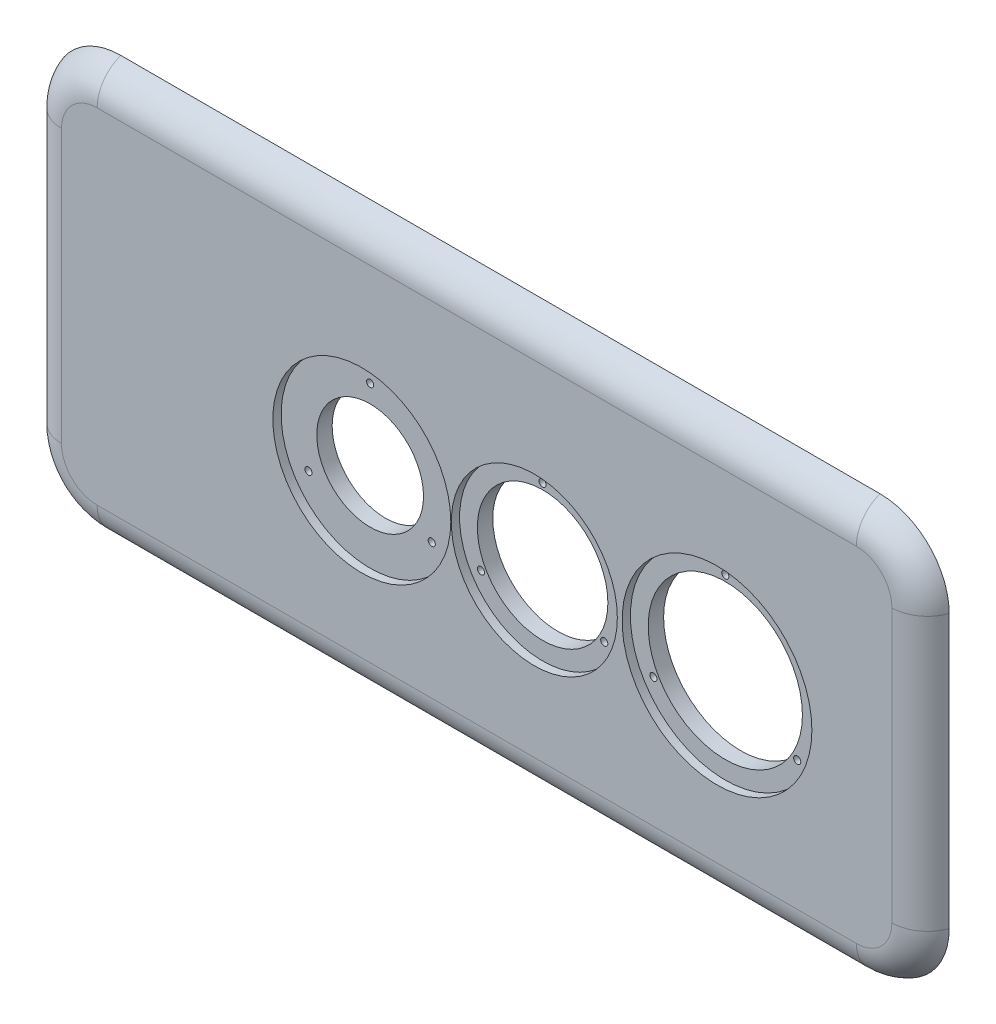
ISO-10303-21;
HEADER;
FILE_DESCRIPTION(('STEP AP214'),'2;1');
FILE_NAME('part.step','',(''),(''),'','','');
FILE_SCHEMA(('AUTOMOTIVE_DESIGN { 1 0 10303 214 1 1 1 1 }'));
ENDSEC;
DATA;
#1=APPLICATION_CONTEXT('core data for automotive mechanical design processes');
#2=APPLICATION_PROTOCOL_DEFINITION('international standard','automotive_design',2000,#1);
#3=PRODUCT_CONTEXT('',#1,'mechanical');
#4=PRODUCT('Part','Part','',(#3));
#5=PRODUCT_RELATED_PRODUCT_CATEGORY('part','',(#4));
#6=PRODUCT_DEFINITION_FORMATION('','',#4);
#7=PRODUCT_DEFINITION_CONTEXT('part definition',#1,'design');
#8=PRODUCT_DEFINITION('design','',#6,#7);
#9=PRODUCT_DEFINITION_SHAPE('','',#8);
#10=(LENGTH_UNIT() NAMED_UNIT(*) SI_UNIT(.MILLI.,.METRE.));
#11=(NAMED_UNIT(*) PLANE_ANGLE_UNIT() SI_UNIT($,.RADIAN.));
#12=(NAMED_UNIT(*) SI_UNIT($,.STERADIAN.) SOLID_ANGLE_UNIT());
#13=UNCERTAINTY_MEASURE_WITH_UNIT(LENGTH_MEASURE(1.E-05),#10,'distance_accuracy_value','');
#14=(GEOMETRIC_REPRESENTATION_CONTEXT(3) GLOBAL_UNCERTAINTY_ASSIGNED_CONTEXT((#13)) GLOBAL_UNIT_ASSIGNED_CONTEXT((#10,
#11,#12)) REPRESENTATION_CONTEXT('',''));
#15=CARTESIAN_POINT('',(0.,0.,0.));
#16=DIRECTION('',(0.,0.,1.));
#17=DIRECTION('',(1.,0.,0.));
#18=AXIS2_PLACEMENT_3D('',#15,#16,#17);
#19=CARTESIAN_POINT('',(245.403137254902,24.6560784313726,0.));
#20=DIRECTION('',(0.,0.,1.));
#21=DIRECTION('',(1.,0.,0.));
#22=AXIS2_PLACEMENT_3D('',#19,#20,#21);
#23=CYLINDRICAL_SURFACE('',#22,65.);
#24=CARTESIAN_POINT('',(245.403137254902,24.6560784313726,18.));
#25=DIRECTION('',(0.,0.,-1.));
#26=DIRECTION('',(-1.,0.,0.));
#27=AXIS2_PLACEMENT_3D('',#24,#25,#26);
#28=CIRCLE('',#27,65.);
#29=CARTESIAN_POINT('',(180.403137254902,24.6560784313726,18.));
#30=VERTEX_POINT('',#29);
#31=EDGE_CURVE('E270',#30,#30,#28,.F.);
#32=ORIENTED_EDGE('',*,*,#31,.F.);
#33=EDGE_LOOP('',(#32));
#34=FACE_BOUND('',#33,.T.);
#35=CARTESIAN_POINT('',(245.403137254902,24.6560784313726,31.));
#36=DIRECTION('',(0.,0.,1.));
#37=DIRECTION('',(1.,0.,0.));
#38=AXIS2_PLACEMENT_3D('',#35,#36,#37);
#39=CIRCLE('',#38,65.);
#40=CARTESIAN_POINT('',(310.403137254902,24.6560784313726,31.));
#41=VERTEX_POINT('',#40);
#42=EDGE_CURVE('E607',#41,#41,#39,.F.);
#43=ORIENTED_EDGE('',*,*,#42,.F.);
#44=EDGE_LOOP('',(#43));
#45=FACE_BOUND('',#44,.T.);
#46=ADVANCED_FACE('F42',(#34,#45),#23,.F.);
#47=CARTESIAN_POINT('',(91.4031372549019,24.6560784313726,0.));
#48=DIRECTION('',(0.,0.,1.));
#49=DIRECTION('',(1.,0.,0.));
#50=AXIS2_PLACEMENT_3D('',#47,#48,#49);
#51=CYLINDRICAL_SURFACE('',#50,55.);
#52=CARTESIAN_POINT('',(91.4031372549019,24.6560784313726,31.));
#53=DIRECTION('',(0.,0.,1.));
#54=DIRECTION('',(1.,0.,0.));
#55=AXIS2_PLACEMENT_3D('',#52,#53,#54);
#56=CIRCLE('',#55,55.);
#57=CARTESIAN_POINT('',(146.403137254902,24.6560784313726,31.));
#58=VERTEX_POINT('',#57);
#59=EDGE_CURVE('E165',#58,#58,#56,.F.);
#60=ORIENTED_EDGE('',*,*,#59,.F.);
#61=EDGE_LOOP('',(#60));
#62=FACE_BOUND('',#61,.T.);
#63=CARTESIAN_POINT('',(91.4031372549019,24.6560784313726,18.));
#64=DIRECTION('',(0.,0.,-1.));
#65=DIRECTION('',(-1.,0.,0.));
#66=AXIS2_PLACEMENT_3D('',#63,#64,#65);
#67=CIRCLE('',#66,55.);
#68=CARTESIAN_POINT('',(36.4031372549019,24.6560784313726,18.));
#69=VERTEX_POINT('',#68);
#70=EDGE_CURVE('E131',#69,#69,#67,.F.);
#71=ORIENTED_EDGE('',*,*,#70,.F.);
#72=EDGE_LOOP('',(#71));
#73=FACE_BOUND('',#72,.T.);
#74=ADVANCED_FACE('F305',(#62,#73),#51,.F.);
#75=CARTESIAN_POINT('',(-54.0068627450981,24.6560784313725,0.));
#76=DIRECTION('',(0.,0.,1.));
#77=DIRECTION('',(1.,0.,0.));
#78=AXIS2_PLACEMENT_3D('',#75,#76,#77);
#79=CYLINDRICAL_SURFACE('',#78,45.);
#80=CARTESIAN_POINT('',(-54.0068627450981,24.6560784313725,31.));
#81=DIRECTION('',(0.,0.,1.));
#82=DIRECTION('',(1.,0.,0.));
#83=AXIS2_PLACEMENT_3D('',#80,#81,#82);
#84=CIRCLE('',#83,45.);
#85=CARTESIAN_POINT('',(-9.00686274509806,24.6560784313725,31.));
#86=VERTEX_POINT('',#85);
#87=EDGE_CURVE('E189',#86,#86,#84,.F.);
#88=ORIENTED_EDGE('',*,*,#87,.F.);
#89=EDGE_LOOP('',(#88));
#90=FACE_BOUND('',#89,.T.);
#91=CARTESIAN_POINT('',(-54.0068627450981,24.6560784313725,18.));
#92=DIRECTION('',(0.,0.,-1.));
#93=DIRECTION('',(-1.,0.,0.));
#94=AXIS2_PLACEMENT_3D('',#91,#92,#93);
#95=CIRCLE('',#94,45.);
#96=CARTESIAN_POINT('',(-99.006862745098,24.6560784313725,18.));
#97=VERTEX_POINT('',#96);
#98=EDGE_CURVE('E274',#97,#97,#95,.F.);
#99=ORIENTED_EDGE('',*,*,#98,.F.);
#100=EDGE_LOOP('',(#99));
#101=FACE_BOUND('',#100,.T.);
#102=ADVANCED_FACE('F301',(#90,#101),#79,.F.);
#103=CARTESIAN_POINT('',(91.4031372549019,84.6560784313725,0.));
#104=DIRECTION('',(0.,0.,1.));
#105=DIRECTION('',(1.,0.,0.));
#106=AXIS2_PLACEMENT_3D('',#103,#104,#105);
#107=CYLINDRICAL_SURFACE('',#106,3.00000000000001);
#108=CARTESIAN_POINT('',(91.4031372549019,84.6560784313725,31.));
#109=DIRECTION('',(0.,0.,1.));
#110=DIRECTION('',(1.,0.,0.));
#111=AXIS2_PLACEMENT_3D('',#108,#109,#110);
#112=CIRCLE('',#111,3.00000000000001);
#113=CARTESIAN_POINT('',(94.4031372549019,84.6560784313725,31.));
#114=VERTEX_POINT('',#113);
#115=EDGE_CURVE('E149',#114,#114,#112,.T.);
#116=ORIENTED_EDGE('',*,*,#115,.T.);
#117=EDGE_LOOP('',(#116));
#118=FACE_BOUND('',#117,.T.);
#119=CARTESIAN_POINT('',(91.4031372549019,84.6560784313725,18.));
#120=DIRECTION('',(0.,0.,-1.));
#121=DIRECTION('',(-1.,0.,0.));
#122=AXIS2_PLACEMENT_3D('',#119,#120,#121);
#123=CIRCLE('',#122,3.00000000000001);
#124=CARTESIAN_POINT('',(88.4031372549019,84.6560784313725,18.));
#125=VERTEX_POINT('',#124);
#126=EDGE_CURVE('E266',#125,#125,#123,.F.);
#127=ORIENTED_EDGE('',*,*,#126,.F.);
#128=EDGE_LOOP('',(#127));
#129=FACE_BOUND('',#128,.T.);
#130=ADVANCED_FACE('F304',(#118,#129),#107,.F.);
#131=CARTESIAN_POINT('',(39.4416130278356,-5.34392156862745,0.));
#132=DIRECTION('',(0.,0.,1.));
#133=DIRECTION('',(1.,0.,0.));
#134=AXIS2_PLACEMENT_3D('',#131,#132,#133);
#135=CYLINDRICAL_SURFACE('',#134,2.99999999999769);
#136=CARTESIAN_POINT('',(39.4416130278356,-5.34392156862745,31.));
#137=DIRECTION('',(0.,0.,1.));
#138=DIRECTION('',(1.,0.,0.));
#139=AXIS2_PLACEMENT_3D('',#136,#137,#138);
#140=CIRCLE('',#139,2.99999999999769);
#141=CARTESIAN_POINT('',(42.4416130278333,-5.34392156862745,31.));
#142=VERTEX_POINT('',#141);
#143=EDGE_CURVE('E156',#142,#142,#140,.T.);
#144=ORIENTED_EDGE('',*,*,#143,.T.);
#145=EDGE_LOOP('',(#144));
#146=FACE_BOUND('',#145,.T.);
#147=CARTESIAN_POINT('',(39.4416130278356,-5.34392156862745,18.));
#148=DIRECTION('',(0.,0.,-1.));
#149=DIRECTION('',(-1.,0.,0.));
#150=AXIS2_PLACEMENT_3D('',#147,#148,#149);
#151=CIRCLE('',#150,2.99999999999769);
#152=CARTESIAN_POINT('',(36.4416130278379,-5.34392156862745,18.));
#153=VERTEX_POINT('',#152);
#154=EDGE_CURVE('E262',#153,#153,#151,.F.);
#155=ORIENTED_EDGE('',*,*,#154,.F.);
#156=EDGE_LOOP('',(#155));
#157=FACE_BOUND('',#156,.T.);
#158=ADVANCED_FACE('F364',(#146,#157),#135,.F.);
#159=CARTESIAN_POINT('',(143.364661481968,-5.3439215686274,0.));
#160=DIRECTION('',(0.,0.,1.));
#161=DIRECTION('',(1.,0.,0.));
#162=AXIS2_PLACEMENT_3D('',#159,#160,#161);
#163=CYLINDRICAL_SURFACE('',#162,2.99999999999833);
#164=CARTESIAN_POINT('',(143.364661481968,-5.3439215686274,31.));
#165=DIRECTION('',(0.,0.,1.));
#166=DIRECTION('',(1.,0.,0.));
#167=AXIS2_PLACEMENT_3D('',#164,#165,#166);
#168=CIRCLE('',#167,2.99999999999833);
#169=CARTESIAN_POINT('',(146.364661481967,-5.3439215686274,31.));
#170=VERTEX_POINT('',#169);
#171=EDGE_CURVE('E162',#170,#170,#168,.T.);
#172=ORIENTED_EDGE('',*,*,#171,.T.);
#173=EDGE_LOOP('',(#172));
#174=FACE_BOUND('',#173,.T.);
#175=CARTESIAN_POINT('',(143.364661481968,-5.3439215686274,18.));
#176=DIRECTION('',(0.,0.,-1.));
#177=DIRECTION('',(-1.,0.,0.));
#178=AXIS2_PLACEMENT_3D('',#175,#176,#177);
#179=CIRCLE('',#178,2.99999999999833);
#180=CARTESIAN_POINT('',(140.36466148197,-5.3439215686274,18.));
#181=VERTEX_POINT('',#180);
#182=EDGE_CURVE('E258',#181,#181,#179,.F.);
#183=ORIENTED_EDGE('',*,*,#182,.F.);
#184=EDGE_LOOP('',(#183));
#185=FACE_BOUND('',#184,.T.);
#186=ADVANCED_FACE('F367',(#174,#185),#163,.F.);
#187=CARTESIAN_POINT('',(-54.0068627450981,84.6560784313725,0.));
#188=DIRECTION('',(0.,0.,1.));
#189=DIRECTION('',(1.,0.,0.));
#190=AXIS2_PLACEMENT_3D('',#187,#188,#189);
#191=CYLINDRICAL_SURFACE('',#190,3.);
#192=CARTESIAN_POINT('',(-54.0068627450981,84.6560784313725,31.));
#193=DIRECTION('',(0.,0.,1.));
#194=DIRECTION('',(1.,0.,0.));
#195=AXIS2_PLACEMENT_3D('',#192,#193,#194);
#196=CIRCLE('',#195,3.);
#197=CARTESIAN_POINT('',(-51.0068627450981,84.6560784313725,31.));
#198=VERTEX_POINT('',#197);
#199=EDGE_CURVE('E171',#198,#198,#196,.T.);
#200=ORIENTED_EDGE('',*,*,#199,.T.);
#201=EDGE_LOOP('',(#200));
#202=FACE_BOUND('',#201,.T.);
#203=CARTESIAN_POINT('',(-54.0068627450981,84.6560784313725,18.));
#204=DIRECTION('',(0.,0.,-1.));
#205=DIRECTION('',(-1.,0.,0.));
#206=AXIS2_PLACEMENT_3D('',#203,#204,#205);
#207=CIRCLE('',#206,3.);
#208=CARTESIAN_POINT('',(-57.0068627450981,84.6560784313725,18.));
#209=VERTEX_POINT('',#208);
#210=EDGE_CURVE('E254',#209,#209,#207,.F.);
#211=ORIENTED_EDGE('',*,*,#210,.F.);
#212=EDGE_LOOP('',(#211));
#213=FACE_BOUND('',#212,.T.);
#214=ADVANCED_FACE('F357',(#202,#213),#191,.F.);
#215=CARTESIAN_POINT('',(-105.968386972163,-5.34392156862772,0.));
#216=DIRECTION('',(0.,0.,1.));
#217=DIRECTION('',(1.,0.,0.));
#218=AXIS2_PLACEMENT_3D('',#215,#216,#217);
#219=CYLINDRICAL_SURFACE('',#218,3.00000000000001);
#220=CARTESIAN_POINT('',(-105.968386972163,-5.34392156862772,31.));
#221=DIRECTION('',(0.,0.,1.));
#222=DIRECTION('',(1.,0.,0.));
#223=AXIS2_PLACEMENT_3D('',#220,#221,#222);
#224=CIRCLE('',#223,3.00000000000001);
#225=CARTESIAN_POINT('',(-102.968386972163,-5.34392156862772,31.));
#226=VERTEX_POINT('',#225);
#227=EDGE_CURVE('E175',#226,#226,#224,.T.);
#228=ORIENTED_EDGE('',*,*,#227,.T.);
#229=EDGE_LOOP('',(#228));
#230=FACE_BOUND('',#229,.T.);
#231=CARTESIAN_POINT('',(-105.968386972163,-5.34392156862772,18.));
#232=DIRECTION('',(0.,0.,-1.));
#233=DIRECTION('',(-1.,0.,0.));
#234=AXIS2_PLACEMENT_3D('',#231,#232,#233);
#235=CIRCLE('',#234,3.00000000000001);
#236=CARTESIAN_POINT('',(-108.968386972163,-5.34392156862772,18.));
#237=VERTEX_POINT('',#236);
#238=EDGE_CURVE('E250',#237,#237,#235,.F.);
#239=ORIENTED_EDGE('',*,*,#238,.F.);
#240=EDGE_LOOP('',(#239));
#241=FACE_BOUND('',#240,.T.);
#242=ADVANCED_FACE('F351',(#230,#241),#219,.F.);
#243=CARTESIAN_POINT('',(-2.0453385180306,-5.34392156862697,0.));
#244=DIRECTION('',(0.,0.,1.));
#245=DIRECTION('',(1.,0.,0.));
#246=AXIS2_PLACEMENT_3D('',#243,#244,#245);
#247=CYLINDRICAL_SURFACE('',#246,3.);
#248=CARTESIAN_POINT('',(-2.0453385180306,-5.34392156862697,31.));
#249=DIRECTION('',(0.,0.,1.));
#250=DIRECTION('',(1.,0.,0.));
#251=AXIS2_PLACEMENT_3D('',#248,#249,#250);
#252=CIRCLE('',#251,3.);
#253=CARTESIAN_POINT('',(0.954661481969402,-5.34392156862697,31.));
#254=VERTEX_POINT('',#253);
#255=EDGE_CURVE('E179',#254,#254,#252,.T.);
#256=ORIENTED_EDGE('',*,*,#255,.T.);
#257=EDGE_LOOP('',(#256));
#258=FACE_BOUND('',#257,.T.);
#259=CARTESIAN_POINT('',(-2.0453385180306,-5.34392156862697,18.));
#260=DIRECTION('',(0.,0.,-1.));
#261=DIRECTION('',(-1.,0.,0.));
#262=AXIS2_PLACEMENT_3D('',#259,#260,#261);
#263=CIRCLE('',#262,3.);
#264=CARTESIAN_POINT('',(-5.0453385180306,-5.34392156862697,18.));
#265=VERTEX_POINT('',#264);
#266=EDGE_CURVE('E246',#265,#265,#263,.F.);
#267=ORIENTED_EDGE('',*,*,#266,.F.);
#268=EDGE_LOOP('',(#267));
#269=FACE_BOUND('',#268,.T.);
#270=ADVANCED_FACE('F347',(#258,#269),#247,.F.);
#271=CARTESIAN_POINT('',(-277.156862745098,-82.3039215686274,8.));
#272=DIRECTION('',(0.,0.,1.));
#273=DIRECTION('',(1.,0.,0.));
#274=AXIS2_PLACEMENT_3D('',#271,#272,#273);
#275=DEGENERATE_TOROIDAL_SURFACE('',#274,30.,30.,.T.);
#276=CARTESIAN_POINT('',(-307.156862745098,-82.3039215686274,8.));
#277=DIRECTION('',(0.,1.,0.));
#278=DIRECTION('',(0.,0.,1.));
#279=AXIS2_PLACEMENT_3D('',#276,#277,#278);
#280=CIRCLE('',#279,30.);
#281=CARTESIAN_POINT('',(-335.44113399256,-82.3039215686274,18.));
#282=VERTEX_POINT('',#281);
#283=CARTESIAN_POINT('',(-307.156862745098,-82.3039215686274,38.));
#284=VERTEX_POINT('',#283);
#285=EDGE_CURVE('E144',#282,#284,#280,.T.);
#286=ORIENTED_EDGE('',*,*,#285,.F.);
#287=CARTESIAN_POINT('',(-277.156862745098,-82.3039215686274,18.));
#288=DIRECTION('',(0.,0.,-1.));
#289=DIRECTION('',(-1.,0.,0.));
#290=AXIS2_PLACEMENT_3D('',#287,#288,#289);
#291=CIRCLE('',#290,58.2842712474619);
#292=CARTESIAN_POINT('',(-277.156862745098,-140.588192816089,18.));
#293=VERTEX_POINT('',#292);
#294=EDGE_CURVE('E227',#282,#293,#291,.F.);
#295=ORIENTED_EDGE('',*,*,#294,.T.);
#296=CARTESIAN_POINT('',(-277.156862745098,-112.303921568627,8.));
#297=DIRECTION('',(1.,0.,0.));
#298=DIRECTION('',(0.,0.,-1.));
#299=AXIS2_PLACEMENT_3D('',#296,#297,#298);
#300=CIRCLE('',#299,30.);
#301=CARTESIAN_POINT('',(-277.156862745098,-112.303921568627,38.));
#302=VERTEX_POINT('',#301);
#303=EDGE_CURVE('E146',#302,#293,#300,.T.);
#304=ORIENTED_EDGE('',*,*,#303,.F.);
#305=CARTESIAN_POINT('',(-277.156862745098,-82.3039215686274,38.));
#306=DIRECTION('',(0.,0.,1.));
#307=DIRECTION('',(1.,0.,0.));
#308=AXIS2_PLACEMENT_3D('',#305,#306,#307);
#309=CIRCLE('',#308,30.);
#310=EDGE_CURVE('E197',#284,#302,#309,.T.);
#311=ORIENTED_EDGE('',*,*,#310,.F.);
#312=EDGE_LOOP('',(#286,#295,#304,#311));
#313=FACE_BOUND('',#312,.T.);
#314=ADVANCED_FACE('F44',(#313),#275,.T.);
#315=CARTESIAN_POINT('',(0.,-112.303921568627,8.));
#316=DIRECTION('',(-1.,0.,0.));
#317=DIRECTION('',(0.,0.,1.));
#318=AXIS2_PLACEMENT_3D('',#315,#316,#317);
#319=CYLINDRICAL_SURFACE('',#318,30.);
#320=ORIENTED_EDGE('',*,*,#303,.T.);
#321=DIRECTION('',(-1.,0.,0.));
#322=VECTOR('',#321,1.);
#323=CARTESIAN_POINT('',(0.,-140.588192816089,18.));
#324=LINE('',#323,#322);
#325=CARTESIAN_POINT('',(362.843137254901,-140.588192816089,18.));
#326=VERTEX_POINT('',#325);
#327=EDGE_CURVE('E238',#293,#326,#324,.F.);
#328=ORIENTED_EDGE('',*,*,#327,.T.);
#329=CARTESIAN_POINT('',(362.843137254902,-112.303921568627,8.));
#330=DIRECTION('',(1.,0.,0.));
#331=DIRECTION('',(0.,1.,0.));
#332=AXIS2_PLACEMENT_3D('',#329,#330,#331);
#333=CIRCLE('',#332,30.);
#334=CARTESIAN_POINT('',(362.843137254902,-112.303921568627,38.));
#335=VERTEX_POINT('',#334);
#336=EDGE_CURVE('E140',#335,#326,#333,.T.);
#337=ORIENTED_EDGE('',*,*,#336,.F.);
#338=DIRECTION('',(1.,0.,0.));
#339=VECTOR('',#338,1.);
#340=CARTESIAN_POINT('',(362.843137254901,-112.303921568627,38.));
#341=LINE('',#340,#339);
#342=EDGE_CURVE('E200',#302,#335,#341,.T.);
#343=ORIENTED_EDGE('',*,*,#342,.F.);
#344=EDGE_LOOP('',(#320,#328,#337,#343));
#345=FACE_BOUND('',#344,.T.);
#346=ADVANCED_FACE('F229',(#345),#319,.T.);
#347=CARTESIAN_POINT('',(-307.156862745098,0.,8.));
#348=DIRECTION('',(0.,1.,0.));
#349=DIRECTION('',(-1.,0.,0.));
#350=AXIS2_PLACEMENT_3D('',#347,#348,#349);
#351=CYLINDRICAL_SURFACE('',#350,30.);
#352=CARTESIAN_POINT('',(-307.156862745098,147.696078431372,8.));
#353=DIRECTION('',(0.,1.,0.));
#354=DIRECTION('',(0.,0.,1.));
#355=AXIS2_PLACEMENT_3D('',#352,#353,#354);
#356=CIRCLE('',#355,30.);
#357=CARTESIAN_POINT('',(-335.44113399256,147.696078431372,18.));
#358=VERTEX_POINT('',#357);
#359=CARTESIAN_POINT('',(-307.156862745098,147.696078431372,38.));
#360=VERTEX_POINT('',#359);
#361=EDGE_CURVE('E137',#358,#360,#356,.T.);
#362=ORIENTED_EDGE('',*,*,#361,.F.);
#363=DIRECTION('',(0.,1.,0.));
#364=VECTOR('',#363,1.);
#365=CARTESIAN_POINT('',(-335.44113399256,0.,18.));
#366=LINE('',#365,#364);
#367=EDGE_CURVE('E222',#358,#282,#366,.F.);
#368=ORIENTED_EDGE('',*,*,#367,.T.);
#369=ORIENTED_EDGE('',*,*,#285,.T.);
#370=DIRECTION('',(0.,-1.,0.));
#371=VECTOR('',#370,1.);
#372=CARTESIAN_POINT('',(-307.156862745098,-82.3039215686274,38.));
#373=LINE('',#372,#371);
#374=EDGE_CURVE('E193',#360,#284,#373,.T.);
#375=ORIENTED_EDGE('',*,*,#374,.F.);
#376=EDGE_LOOP('',(#362,#368,#369,#375));
#377=FACE_BOUND('',#376,.T.);
#378=ADVANCED_FACE('F221',(#377),#351,.T.);
#379=CARTESIAN_POINT('',(362.843137254902,-82.3039215686274,8.));
#380=DIRECTION('',(0.,0.,1.));
#381=DIRECTION('',(1.,0.,0.));
#382=AXIS2_PLACEMENT_3D('',#379,#380,#381);
#383=DEGENERATE_TOROIDAL_SURFACE('',#382,30.,30.,.T.);
#384=ORIENTED_EDGE('',*,*,#336,.T.);
#385=CARTESIAN_POINT('',(362.843137254902,-82.3039215686274,18.));
#386=DIRECTION('',(0.,0.,-1.));
#387=DIRECTION('',(-1.,0.,0.));
#388=AXIS2_PLACEMENT_3D('',#385,#386,#387);
#389=CIRCLE('',#388,58.2842712474619);
#390=CARTESIAN_POINT('',(421.127408502364,-82.303921568627,18.));
#391=VERTEX_POINT('',#390);
#392=EDGE_CURVE('E233',#326,#391,#389,.F.);
#393=ORIENTED_EDGE('',*,*,#392,.T.);
#394=CARTESIAN_POINT('',(392.843137254902,-82.303921568627,8.));
#395=DIRECTION('',(0.,1.,0.));
#396=DIRECTION('',(0.,0.,1.));
#397=AXIS2_PLACEMENT_3D('',#394,#395,#396);
#398=CIRCLE('',#397,30.);
#399=CARTESIAN_POINT('',(392.843137254902,-82.303921568627,38.));
#400=VERTEX_POINT('',#399);
#401=EDGE_CURVE('E119',#400,#391,#398,.T.);
#402=ORIENTED_EDGE('',*,*,#401,.F.);
#403=CARTESIAN_POINT('',(362.843137254902,-82.3039215686274,38.));
#404=DIRECTION('',(0.,0.,1.));
#405=DIRECTION('',(1.,0.,0.));
#406=AXIS2_PLACEMENT_3D('',#403,#404,#405);
#407=CIRCLE('',#406,30.);
#408=EDGE_CURVE('E203',#335,#400,#407,.T.);
#409=ORIENTED_EDGE('',*,*,#408,.F.);
#410=EDGE_LOOP('',(#384,#393,#402,#409));
#411=FACE_BOUND('',#410,.T.);
#412=ADVANCED_FACE('F232',(#411),#383,.T.);
#413=CARTESIAN_POINT('',(-277.156862745098,147.696078431373,8.));
#414=DIRECTION('',(0.,0.,1.));
#415=DIRECTION('',(1.,0.,0.));
#416=AXIS2_PLACEMENT_3D('',#413,#414,#415);
#417=DEGENERATE_TOROIDAL_SURFACE('',#416,30.,30.,.T.);
#418=CARTESIAN_POINT('',(-277.156862745098,177.696078431373,8.));
#419=DIRECTION('',(1.,0.,0.));
#420=DIRECTION('',(0.,1.,0.));
#421=AXIS2_PLACEMENT_3D('',#418,#419,#420);
#422=CIRCLE('',#421,30.);
#423=CARTESIAN_POINT('',(-277.156862745098,205.980349678835,18.));
#424=VERTEX_POINT('',#423);
#425=CARTESIAN_POINT('',(-277.156862745098,177.696078431373,38.));
#426=VERTEX_POINT('',#425);
#427=EDGE_CURVE('E125',#424,#426,#422,.T.);
#428=ORIENTED_EDGE('',*,*,#427,.F.);
#429=CARTESIAN_POINT('',(-277.156862745098,147.696078431373,18.));
#430=DIRECTION('',(0.,0.,-1.));
#431=DIRECTION('',(-1.,0.,0.));
#432=AXIS2_PLACEMENT_3D('',#429,#430,#431);
#433=CIRCLE('',#432,58.2842712474619);
#434=EDGE_CURVE('E121',#424,#358,#433,.F.);
#435=ORIENTED_EDGE('',*,*,#434,.T.);
#436=ORIENTED_EDGE('',*,*,#361,.T.);
#437=CARTESIAN_POINT('',(-277.156862745098,147.696078431373,38.));
#438=DIRECTION('',(0.,0.,1.));
#439=DIRECTION('',(1.,0.,0.));
#440=AXIS2_PLACEMENT_3D('',#437,#438,#439);
#441=CIRCLE('',#440,30.);
#442=EDGE_CURVE('E188',#426,#360,#441,.T.);
#443=ORIENTED_EDGE('',*,*,#442,.F.);
#444=EDGE_LOOP('',(#428,#435,#436,#443));
#445=FACE_BOUND('',#444,.T.);
#446=ADVANCED_FACE('F216',(#445),#417,.T.);
#447=CARTESIAN_POINT('',(392.843137254902,0.,8.));
#448=DIRECTION('',(0.,-1.,0.));
#449=DIRECTION('',(0.,0.,-1.));
#450=AXIS2_PLACEMENT_3D('',#447,#448,#449);
#451=CYLINDRICAL_SURFACE('',#450,30.);
#452=ORIENTED_EDGE('',*,*,#401,.T.);
#453=DIRECTION('',(0.,-1.,0.));
#454=VECTOR('',#453,1.);
#455=CARTESIAN_POINT('',(421.127408502364,0.,18.));
#456=LINE('',#455,#454);
#457=CARTESIAN_POINT('',(421.127408502364,147.696078431372,18.));
#458=VERTEX_POINT('',#457);
#459=EDGE_CURVE('E108',#391,#458,#456,.F.);
#460=ORIENTED_EDGE('',*,*,#459,.T.);
#461=CARTESIAN_POINT('',(392.843137254902,147.696078431372,8.));
#462=DIRECTION('',(0.,1.,0.));
#463=DIRECTION('',(-1.,0.,0.));
#464=AXIS2_PLACEMENT_3D('',#461,#462,#463);
#465=CIRCLE('',#464,30.);
#466=CARTESIAN_POINT('',(392.843137254902,147.696078431372,38.));
#467=VERTEX_POINT('',#466);
#468=EDGE_CURVE('E116',#467,#458,#465,.T.);
#469=ORIENTED_EDGE('',*,*,#468,.F.);
#470=DIRECTION('',(0.,1.,0.));
#471=VECTOR('',#470,1.);
#472=CARTESIAN_POINT('',(392.843137254902,147.696078431372,38.));
#473=LINE('',#472,#471);
#474=EDGE_CURVE('E65',#400,#467,#473,.T.);
#475=ORIENTED_EDGE('',*,*,#474,.F.);
#476=EDGE_LOOP('',(#452,#460,#469,#475));
#477=FACE_BOUND('',#476,.T.);
#478=ADVANCED_FACE('F115',(#477),#451,.T.);
#479=CARTESIAN_POINT('',(0.,177.696078431373,8.));
#480=DIRECTION('',(1.,0.,0.));
#481=DIRECTION('',(0.,0.,-1.));
#482=AXIS2_PLACEMENT_3D('',#479,#480,#481);
#483=CYLINDRICAL_SURFACE('',#482,30.);
#484=CARTESIAN_POINT('',(362.843137254901,177.696078431373,8.));
#485=DIRECTION('',(1.,0.,0.));
#486=DIRECTION('',(0.,0.,-1.));
#487=AXIS2_PLACEMENT_3D('',#484,#485,#486);
#488=CIRCLE('',#487,30.);
#489=CARTESIAN_POINT('',(362.843137254902,205.980349678835,18.));
#490=VERTEX_POINT('',#489);
#491=CARTESIAN_POINT('',(362.843137254902,177.696078431373,38.));
#492=VERTEX_POINT('',#491);
#493=EDGE_CURVE('E126',#490,#492,#488,.T.);
#494=ORIENTED_EDGE('',*,*,#493,.F.);
#495=DIRECTION('',(1.,0.,0.));
#496=VECTOR('',#495,1.);
#497=CARTESIAN_POINT('',(0.,205.980349678835,18.));
#498=LINE('',#497,#496);
#499=EDGE_CURVE('E58',#490,#424,#498,.F.);
#500=ORIENTED_EDGE('',*,*,#499,.T.);
#501=ORIENTED_EDGE('',*,*,#427,.T.);
#502=DIRECTION('',(-1.,0.,0.));
#503=VECTOR('',#502,1.);
#504=CARTESIAN_POINT('',(-277.156862745098,177.696078431373,38.));
#505=LINE('',#504,#503);
#506=EDGE_CURVE('E184',#492,#426,#505,.T.);
#507=ORIENTED_EDGE('',*,*,#506,.F.);
#508=EDGE_LOOP('',(#494,#500,#501,#507));
#509=FACE_BOUND('',#508,.T.);
#510=ADVANCED_FACE('F333',(#509),#483,.T.);
#511=CARTESIAN_POINT('',(362.843137254902,147.696078431373,8.));
#512=DIRECTION('',(0.,0.,1.));
#513=DIRECTION('',(1.,0.,0.));
#514=AXIS2_PLACEMENT_3D('',#511,#512,#513);
#515=DEGENERATE_TOROIDAL_SURFACE('',#514,30.,30.,.T.);
#516=ORIENTED_EDGE('',*,*,#468,.T.);
#517=CARTESIAN_POINT('',(362.843137254902,147.696078431373,18.));
#518=DIRECTION('',(0.,0.,-1.));
#519=DIRECTION('',(-1.,0.,0.));
#520=AXIS2_PLACEMENT_3D('',#517,#518,#519);
#521=CIRCLE('',#520,58.2842712474619);
#522=EDGE_CURVE('E12',#458,#490,#521,.F.);
#523=ORIENTED_EDGE('',*,*,#522,.T.);
#524=ORIENTED_EDGE('',*,*,#493,.T.);
#525=CARTESIAN_POINT('',(362.843137254902,147.696078431373,38.));
#526=DIRECTION('',(0.,0.,1.));
#527=DIRECTION('',(1.,0.,0.));
#528=AXIS2_PLACEMENT_3D('',#525,#526,#527);
#529=CIRCLE('',#528,30.);
#530=EDGE_CURVE('E51',#467,#492,#529,.T.);
#531=ORIENTED_EDGE('',*,*,#530,.F.);
#532=EDGE_LOOP('',(#516,#523,#524,#531));
#533=FACE_BOUND('',#532,.T.);
#534=ADVANCED_FACE('F123',(#533),#515,.T.);
#535=CARTESIAN_POINT('',(0.,0.,38.));
#536=DIRECTION('',(0.,0.,1.));
#537=DIRECTION('',(1.,0.,0.));
#538=AXIS2_PLACEMENT_3D('',#535,#536,#537);
#539=PLANE('',#538);
#540=CARTESIAN_POINT('',(245.403137254902,24.6560784313726,38.));
#541=DIRECTION('',(0.,0.,1.));
#542=DIRECTION('',(1.,0.,0.));
#543=AXIS2_PLACEMENT_3D('',#540,#541,#542);
#544=CIRCLE('',#543,80.);
#545=CARTESIAN_POINT('',(325.403137254902,24.6560784313726,38.));
#546=VERTEX_POINT('',#545);
#547=EDGE_CURVE('E602',#546,#546,#544,.T.);
#548=ORIENTED_EDGE('',*,*,#547,.F.);
#549=EDGE_LOOP('',(#548));
#550=FACE_BOUND('',#549,.T.);
#551=ORIENTED_EDGE('',*,*,#474,.T.);
#552=ORIENTED_EDGE('',*,*,#530,.T.);
#553=ORIENTED_EDGE('',*,*,#506,.T.);
#554=ORIENTED_EDGE('',*,*,#442,.T.);
#555=ORIENTED_EDGE('',*,*,#374,.T.);
#556=ORIENTED_EDGE('',*,*,#310,.T.);
#557=ORIENTED_EDGE('',*,*,#342,.T.);
#558=ORIENTED_EDGE('',*,*,#408,.T.);
#559=EDGE_LOOP('',(#551,#552,#553,#554,#555,#556,#557,#558));
#560=FACE_BOUND('',#559,.T.);
#561=CARTESIAN_POINT('',(91.4031372549019,24.6560784313726,38.));
#562=DIRECTION('',(0.,0.,1.));
#563=DIRECTION('',(1.,0.,0.));
#564=AXIS2_PLACEMENT_3D('',#561,#562,#563);
#565=CIRCLE('',#564,70.);
#566=CARTESIAN_POINT('',(161.403137254902,24.6560784313726,38.));
#567=VERTEX_POINT('',#566);
#568=EDGE_CURVE('E183',#567,#567,#565,.T.);
#569=ORIENTED_EDGE('',*,*,#568,.F.);
#570=EDGE_LOOP('',(#569));
#571=FACE_BOUND('',#570,.T.);
#572=CARTESIAN_POINT('',(-54.0068627450981,24.6560784313725,38.));
#573=DIRECTION('',(0.,0.,1.));
#574=DIRECTION('',(1.,0.,0.));
#575=AXIS2_PLACEMENT_3D('',#572,#573,#574);
#576=CIRCLE('',#575,75.);
#577=CARTESIAN_POINT('',(20.993137254902,24.6560784313725,38.));
#578=VERTEX_POINT('',#577);
#579=EDGE_CURVE('E292',#578,#578,#576,.T.);
#580=ORIENTED_EDGE('',*,*,#579,.F.);
#581=EDGE_LOOP('',(#580));
#582=FACE_BOUND('',#581,.T.);
#583=ADVANCED_FACE('F208',(#550,#560,#571,#582),#539,.T.);
#584=CARTESIAN_POINT('',(-54.0068627450981,24.6560784313725,31.));
#585=DIRECTION('',(0.,0.,1.));
#586=DIRECTION('',(1.,0.,0.));
#587=AXIS2_PLACEMENT_3D('',#584,#585,#586);
#588=PLANE('',#587);
#589=ORIENTED_EDGE('',*,*,#255,.F.);
#590=EDGE_LOOP('',(#589));
#591=FACE_BOUND('',#590,.T.);
#592=ORIENTED_EDGE('',*,*,#227,.F.);
#593=EDGE_LOOP('',(#592));
#594=FACE_BOUND('',#593,.T.);
#595=ORIENTED_EDGE('',*,*,#199,.F.);
#596=EDGE_LOOP('',(#595));
#597=FACE_BOUND('',#596,.T.);
#598=CARTESIAN_POINT('',(-54.0068627450981,24.6560784313725,31.));
#599=DIRECTION('',(0.,0.,1.));
#600=DIRECTION('',(1.,0.,0.));
#601=AXIS2_PLACEMENT_3D('',#598,#599,#600);
#602=CIRCLE('',#601,75.);
#603=CARTESIAN_POINT('',(20.993137254902,24.6560784313725,31.));
#604=VERTEX_POINT('',#603);
#605=EDGE_CURVE('E288',#604,#604,#602,.T.);
#606=ORIENTED_EDGE('',*,*,#605,.T.);
#607=EDGE_LOOP('',(#606));
#608=FACE_BOUND('',#607,.T.);
#609=ORIENTED_EDGE('',*,*,#87,.T.);
#610=EDGE_LOOP('',(#609));
#611=FACE_BOUND('',#610,.T.);
#612=ADVANCED_FACE('F299',(#591,#594,#597,#608,#611),#588,.T.);
#613=CARTESIAN_POINT('',(-54.0068627450981,24.6560784313725,31.));
#614=DIRECTION('',(0.,0.,1.));
#615=DIRECTION('',(1.,0.,0.));
#616=AXIS2_PLACEMENT_3D('',#613,#614,#615);
#617=CYLINDRICAL_SURFACE('',#616,75.);
#618=ORIENTED_EDGE('',*,*,#605,.F.);
#619=EDGE_LOOP('',(#618));
#620=FACE_BOUND('',#619,.T.);
#621=ORIENTED_EDGE('',*,*,#579,.T.);
#622=EDGE_LOOP('',(#621));
#623=FACE_BOUND('',#622,.T.);
#624=ADVANCED_FACE('F378',(#620,#623),#617,.F.);
#625=CARTESIAN_POINT('',(91.4031372549019,24.6560784313726,31.));
#626=DIRECTION('',(0.,0.,1.));
#627=DIRECTION('',(1.,0.,0.));
#628=AXIS2_PLACEMENT_3D('',#625,#626,#627);
#629=PLANE('',#628);
#630=ORIENTED_EDGE('',*,*,#171,.F.);
#631=EDGE_LOOP('',(#630));
#632=FACE_BOUND('',#631,.T.);
#633=ORIENTED_EDGE('',*,*,#143,.F.);
#634=EDGE_LOOP('',(#633));
#635=FACE_BOUND('',#634,.T.);
#636=ORIENTED_EDGE('',*,*,#115,.F.);
#637=EDGE_LOOP('',(#636));
#638=FACE_BOUND('',#637,.T.);
#639=CARTESIAN_POINT('',(91.4031372549019,24.6560784313726,31.));
#640=DIRECTION('',(0.,0.,1.));
#641=DIRECTION('',(1.,0.,0.));
#642=AXIS2_PLACEMENT_3D('',#639,#640,#641);
#643=CIRCLE('',#642,70.);
#644=CARTESIAN_POINT('',(161.403137254902,24.6560784313726,31.));
#645=VERTEX_POINT('',#644);
#646=EDGE_CURVE('E281',#645,#645,#643,.T.);
#647=ORIENTED_EDGE('',*,*,#646,.T.);
#648=EDGE_LOOP('',(#647));
#649=FACE_BOUND('',#648,.T.);
#650=ORIENTED_EDGE('',*,*,#59,.T.);
#651=EDGE_LOOP('',(#650));
#652=FACE_BOUND('',#651,.T.);
#653=ADVANCED_FACE('F375',(#632,#635,#638,#649,#652),#629,.T.);
#654=CARTESIAN_POINT('',(91.4031372549019,24.6560784313726,31.));
#655=DIRECTION('',(0.,0.,1.));
#656=DIRECTION('',(1.,0.,0.));
#657=AXIS2_PLACEMENT_3D('',#654,#655,#656);
#658=CYLINDRICAL_SURFACE('',#657,70.);
#659=ORIENTED_EDGE('',*,*,#646,.F.);
#660=EDGE_LOOP('',(#659));
#661=FACE_BOUND('',#660,.T.);
#662=ORIENTED_EDGE('',*,*,#568,.T.);
#663=EDGE_LOOP('',(#662));
#664=FACE_BOUND('',#663,.T.);
#665=ADVANCED_FACE('F312',(#661,#664),#658,.F.);
#666=CARTESIAN_POINT('',(0.,0.,18.));
#667=DIRECTION('',(0.,0.,-1.));
#668=DIRECTION('',(-1.,0.,0.));
#669=AXIS2_PLACEMENT_3D('',#666,#667,#668);
#670=PLANE('',#669);
#671=CARTESIAN_POINT('',(245.403137254902,94.6560784313726,18.));
#672=DIRECTION('',(0.,0.,-1.));
#673=DIRECTION('',(-1.,0.,0.));
#674=AXIS2_PLACEMENT_3D('',#671,#672,#673);
#675=CIRCLE('',#674,2.99999999999999);
#676=CARTESIAN_POINT('',(242.403137254902,94.6560784313726,18.));
#677=VERTEX_POINT('',#676);
#678=EDGE_CURVE('E580',#677,#677,#675,.F.);
#679=ORIENTED_EDGE('',*,*,#678,.T.);
#680=EDGE_LOOP('',(#679));
#681=FACE_BOUND('',#680,.T.);
#682=CARTESIAN_POINT('',(184.781358989994,-10.3439215686286,18.));
#683=DIRECTION('',(0.,0.,-1.));
#684=DIRECTION('',(-1.,0.,0.));
#685=AXIS2_PLACEMENT_3D('',#682,#683,#684);
#686=CIRCLE('',#685,2.99999999999999);
#687=CARTESIAN_POINT('',(181.781358989994,-10.3439215686286,18.));
#688=VERTEX_POINT('',#687);
#689=EDGE_CURVE('E583',#688,#688,#686,.F.);
#690=ORIENTED_EDGE('',*,*,#689,.T.);
#691=EDGE_LOOP('',(#690));
#692=FACE_BOUND('',#691,.T.);
#693=CARTESIAN_POINT('',(306.024915519815,-10.343921568626,18.));
#694=DIRECTION('',(0.,0.,-1.));
#695=DIRECTION('',(-1.,0.,0.));
#696=AXIS2_PLACEMENT_3D('',#693,#694,#695);
#697=CIRCLE('',#696,2.99999999999999);
#698=CARTESIAN_POINT('',(303.024915519815,-10.343921568626,18.));
#699=VERTEX_POINT('',#698);
#700=EDGE_CURVE('E591',#699,#699,#697,.F.);
#701=ORIENTED_EDGE('',*,*,#700,.T.);
#702=EDGE_LOOP('',(#701));
#703=FACE_BOUND('',#702,.T.);
#704=ORIENTED_EDGE('',*,*,#367,.F.);
#705=ORIENTED_EDGE('',*,*,#434,.F.);
#706=ORIENTED_EDGE('',*,*,#499,.F.);
#707=ORIENTED_EDGE('',*,*,#522,.F.);
#708=ORIENTED_EDGE('',*,*,#459,.F.);
#709=ORIENTED_EDGE('',*,*,#392,.F.);
#710=ORIENTED_EDGE('',*,*,#327,.F.);
#711=ORIENTED_EDGE('',*,*,#294,.F.);
#712=EDGE_LOOP('',(#704,#705,#706,#707,#708,#709,#710,#711));
#713=FACE_BOUND('',#712,.T.);
#714=ORIENTED_EDGE('',*,*,#266,.T.);
#715=EDGE_LOOP('',(#714));
#716=FACE_BOUND('',#715,.T.);
#717=ORIENTED_EDGE('',*,*,#238,.T.);
#718=EDGE_LOOP('',(#717));
#719=FACE_BOUND('',#718,.T.);
#720=ORIENTED_EDGE('',*,*,#210,.T.);
#721=EDGE_LOOP('',(#720));
#722=FACE_BOUND('',#721,.T.);
#723=ORIENTED_EDGE('',*,*,#182,.T.);
#724=EDGE_LOOP('',(#723));
#725=FACE_BOUND('',#724,.T.);
#726=ORIENTED_EDGE('',*,*,#154,.T.);
#727=EDGE_LOOP('',(#726));
#728=FACE_BOUND('',#727,.T.);
#729=ORIENTED_EDGE('',*,*,#126,.T.);
#730=EDGE_LOOP('',(#729));
#731=FACE_BOUND('',#730,.T.);
#732=ORIENTED_EDGE('',*,*,#31,.T.);
#733=EDGE_LOOP('',(#732));
#734=FACE_BOUND('',#733,.T.);
#735=ORIENTED_EDGE('',*,*,#98,.T.);
#736=EDGE_LOOP('',(#735));
#737=FACE_BOUND('',#736,.T.);
#738=ORIENTED_EDGE('',*,*,#70,.T.);
#739=EDGE_LOOP('',(#738));
#740=FACE_BOUND('',#739,.T.);
#741=ADVANCED_FACE('F106',(#681,#692,#703,#713,#716,#719,#722,#725,#728,#731,#734,#737,#740),
#670,.T.);
#742=CARTESIAN_POINT('',(245.403137254902,24.6560784313726,31.));
#743=DIRECTION('',(0.,0.,1.));
#744=DIRECTION('',(1.,0.,0.));
#745=AXIS2_PLACEMENT_3D('',#742,#743,#744);
#746=CYLINDRICAL_SURFACE('',#745,80.);
#747=CARTESIAN_POINT('',(245.403137254902,24.6560784313726,31.));
#748=DIRECTION('',(0.,0.,1.));
#749=DIRECTION('',(1.,0.,0.));
#750=AXIS2_PLACEMENT_3D('',#747,#748,#749);
#751=CIRCLE('',#750,80.);
#752=CARTESIAN_POINT('',(325.403137254902,24.6560784313726,31.));
#753=VERTEX_POINT('',#752);
#754=EDGE_CURVE('E603',#753,#753,#751,.T.);
#755=ORIENTED_EDGE('',*,*,#754,.F.);
#756=EDGE_LOOP('',(#755));
#757=FACE_BOUND('',#756,.T.);
#758=ORIENTED_EDGE('',*,*,#547,.T.);
#759=EDGE_LOOP('',(#758));
#760=FACE_BOUND('',#759,.T.);
#761=ADVANCED_FACE('F311',(#757,#760),#746,.F.);
#762=CARTESIAN_POINT('',(0.,0.,31.));
#763=DIRECTION('',(0.,0.,1.));
#764=DIRECTION('',(1.,0.,0.));
#765=AXIS2_PLACEMENT_3D('',#762,#763,#764);
#766=PLANE('',#765);
#767=CARTESIAN_POINT('',(184.781358989994,-10.3439215686286,31.));
#768=DIRECTION('',(0.,0.,1.));
#769=DIRECTION('',(1.,0.,0.));
#770=AXIS2_PLACEMENT_3D('',#767,#768,#769);
#771=CIRCLE('',#770,2.99999999999999);
#772=CARTESIAN_POINT('',(187.781358989994,-10.3439215686286,31.));
#773=VERTEX_POINT('',#772);
#774=EDGE_CURVE('E582',#773,#773,#771,.T.);
#775=ORIENTED_EDGE('',*,*,#774,.F.);
#776=EDGE_LOOP('',(#775));
#777=FACE_BOUND('',#776,.T.);
#778=CARTESIAN_POINT('',(245.403137254902,94.6560784313726,31.));
#779=DIRECTION('',(0.,0.,1.));
#780=DIRECTION('',(1.,0.,0.));
#781=AXIS2_PLACEMENT_3D('',#778,#779,#780);
#782=CIRCLE('',#781,2.99999999999999);
#783=CARTESIAN_POINT('',(248.403137254902,94.6560784313726,31.));
#784=VERTEX_POINT('',#783);
#785=EDGE_CURVE('E577',#784,#784,#782,.T.);
#786=ORIENTED_EDGE('',*,*,#785,.F.);
#787=EDGE_LOOP('',(#786));
#788=FACE_BOUND('',#787,.T.);
#789=CARTESIAN_POINT('',(306.024915519815,-10.343921568626,31.));
#790=DIRECTION('',(0.,0.,1.));
#791=DIRECTION('',(1.,0.,0.));
#792=AXIS2_PLACEMENT_3D('',#789,#790,#791);
#793=CIRCLE('',#792,2.99999999999999);
#794=CARTESIAN_POINT('',(309.024915519815,-10.343921568626,31.));
#795=VERTEX_POINT('',#794);
#796=EDGE_CURVE('E588',#795,#795,#793,.T.);
#797=ORIENTED_EDGE('',*,*,#796,.F.);
#798=EDGE_LOOP('',(#797));
#799=FACE_BOUND('',#798,.T.);
#800=ORIENTED_EDGE('',*,*,#754,.T.);
#801=EDGE_LOOP('',(#800));
#802=FACE_BOUND('',#801,.T.);
#803=ORIENTED_EDGE('',*,*,#42,.T.);
#804=EDGE_LOOP('',(#803));
#805=FACE_BOUND('',#804,.T.);
#806=ADVANCED_FACE('F416',(#777,#788,#799,#802,#805),#766,.T.);
#807=CARTESIAN_POINT('',(306.024915519815,-10.343921568626,9.51471862576143));
#808=DIRECTION('',(0.,0.,1.));
#809=DIRECTION('',(1.,0.,0.));
#810=AXIS2_PLACEMENT_3D('',#807,#808,#809);
#811=CYLINDRICAL_SURFACE('',#810,2.99999999999999);
#812=ORIENTED_EDGE('',*,*,#796,.T.);
#813=EDGE_LOOP('',(#812));
#814=FACE_BOUND('',#813,.T.);
#815=ORIENTED_EDGE('',*,*,#700,.F.);
#816=EDGE_LOOP('',(#815));
#817=FACE_BOUND('',#816,.T.);
#818=ADVANCED_FACE('F424',(#814,#817),#811,.F.);
#819=CARTESIAN_POINT('',(184.781358989994,-10.3439215686286,9.51471862576143));
#820=DIRECTION('',(0.,0.,1.));
#821=DIRECTION('',(1.,0.,0.));
#822=AXIS2_PLACEMENT_3D('',#819,#820,#821);
#823=CYLINDRICAL_SURFACE('',#822,2.99999999999999);
#824=ORIENTED_EDGE('',*,*,#774,.T.);
#825=EDGE_LOOP('',(#824));
#826=FACE_BOUND('',#825,.T.);
#827=ORIENTED_EDGE('',*,*,#689,.F.);
#828=EDGE_LOOP('',(#827));
#829=FACE_BOUND('',#828,.T.);
#830=ADVANCED_FACE('F431',(#826,#829),#823,.F.);
#831=CARTESIAN_POINT('',(245.403137254902,94.6560784313726,9.51471862576143));
#832=DIRECTION('',(0.,0.,1.));
#833=DIRECTION('',(1.,0.,0.));
#834=AXIS2_PLACEMENT_3D('',#831,#832,#833);
#835=CYLINDRICAL_SURFACE('',#834,2.99999999999999);
#836=ORIENTED_EDGE('',*,*,#785,.T.);
#837=EDGE_LOOP('',(#836));
#838=FACE_BOUND('',#837,.T.);
#839=ORIENTED_EDGE('',*,*,#678,.F.);
#840=EDGE_LOOP('',(#839));
#841=FACE_BOUND('',#840,.T.);
#842=ADVANCED_FACE('F439',(#838,#841),#835,.F.);
#843=CLOSED_SHELL('',(#46,#74,#102,#130,#158,#186,#214,#242,#270,#314,#346,#378,#412,#446,#478,
#510,#534,#583,#612,#624,#653,#665,#741,#761,#806,#818,#830,#842));
#844=MANIFOLD_SOLID_BREP('B2',#843);
#845=ADVANCED_BREP_SHAPE_REPRESENTATION('',(#18,#844),#14);
#846=SHAPE_DEFINITION_REPRESENTATION(#9,#845);
ENDSEC;
END-ISO-10303-21;
